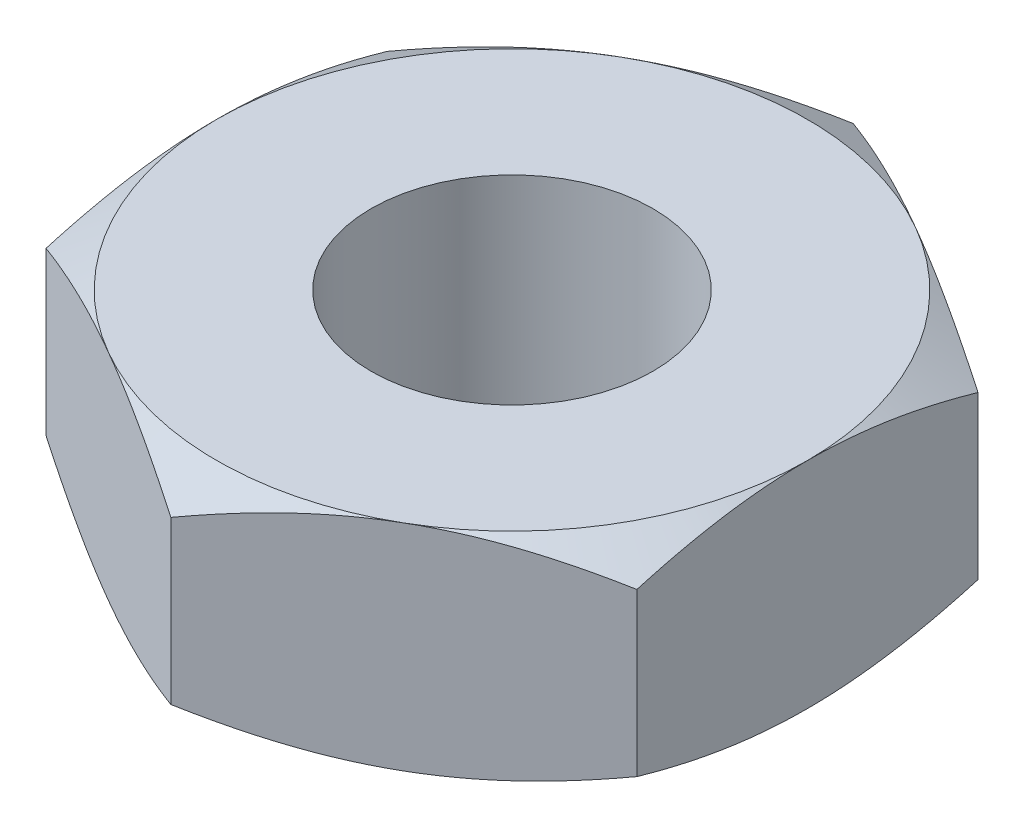
ISO-10303-21;
HEADER;
FILE_DESCRIPTION(('STEP AP214'),'2;1');
FILE_NAME('part.step','',(''),(''),'','','');
FILE_SCHEMA(('AUTOMOTIVE_DESIGN { 1 0 10303 214 1 1 1 1 }'));
ENDSEC;
DATA;
#1=APPLICATION_CONTEXT('core data for automotive mechanical design processes');
#2=APPLICATION_PROTOCOL_DEFINITION('international standard','automotive_design',2000,#1);
#3=PRODUCT_CONTEXT('',#1,'mechanical');
#4=PRODUCT('Part','Part','',(#3));
#5=PRODUCT_RELATED_PRODUCT_CATEGORY('part','',(#4));
#6=PRODUCT_DEFINITION_FORMATION('','',#4);
#7=PRODUCT_DEFINITION_CONTEXT('part definition',#1,'design');
#8=PRODUCT_DEFINITION('design','',#6,#7);
#9=PRODUCT_DEFINITION_SHAPE('','',#8);
#10=(LENGTH_UNIT() NAMED_UNIT(*) SI_UNIT(.MILLI.,.METRE.));
#11=(NAMED_UNIT(*) PLANE_ANGLE_UNIT() SI_UNIT($,.RADIAN.));
#12=(NAMED_UNIT(*) SI_UNIT($,.STERADIAN.) SOLID_ANGLE_UNIT());
#13=UNCERTAINTY_MEASURE_WITH_UNIT(LENGTH_MEASURE(1.E-05),#10,'distance_accuracy_value','');
#14=(GEOMETRIC_REPRESENTATION_CONTEXT(3) GLOBAL_UNCERTAINTY_ASSIGNED_CONTEXT((#13)) GLOBAL_UNIT_ASSIGNED_CONTEXT((#10,
#11,#12)) REPRESENTATION_CONTEXT('',''));
#15=CARTESIAN_POINT('',(0.,0.,0.));
#16=DIRECTION('',(0.,0.,1.));
#17=DIRECTION('',(1.,0.,0.));
#18=AXIS2_PLACEMENT_3D('',#15,#16,#17);
#19=CARTESIAN_POINT('',(-4.365625,1.5875,-2.52049476893096));
#20=DIRECTION('',(0.,1.,0.));
#21=DIRECTION('',(0.,0.,1.));
#22=AXIS2_PLACEMENT_3D('',#19,#20,#21);
#23=PLANE('',#22);
#24=CARTESIAN_POINT('',(0.,1.5875,0.));
#25=DIRECTION('',(0.,1.,0.));
#26=DIRECTION('',(0.,0.,1.));
#27=AXIS2_PLACEMENT_3D('',#24,#25,#26);
#28=CIRCLE('',#27,2.0828);
#29=CARTESIAN_POINT('',(0.,1.5875,2.0828));
#30=VERTEX_POINT('',#29);
#31=EDGE_CURVE('E265',#30,#30,#28,.T.);
#32=ORIENTED_EDGE('',*,*,#31,.F.);
#33=EDGE_LOOP('',(#32));
#34=FACE_BOUND('',#33,.T.);
#35=CARTESIAN_POINT('',(0.,1.5875,0.));
#36=DIRECTION('',(0.,1.,0.));
#37=DIRECTION('',(0.,0.,1.));
#38=AXIS2_PLACEMENT_3D('',#35,#36,#37);
#39=CIRCLE('',#38,4.365625);
#40=CARTESIAN_POINT('',(-2.1828125,1.5875,3.78074215339644));
#41=VERTEX_POINT('',#40);
#42=CARTESIAN_POINT('',(2.1828125,1.5875,3.78074215339644));
#43=VERTEX_POINT('',#42);
#44=EDGE_CURVE('E334',#41,#43,#39,.T.);
#45=ORIENTED_EDGE('',*,*,#44,.T.);
#46=CARTESIAN_POINT('',(4.365625,1.5875,0.));
#47=VERTEX_POINT('',#46);
#48=EDGE_CURVE('E338',#43,#47,#39,.T.);
#49=ORIENTED_EDGE('',*,*,#48,.T.);
#50=CARTESIAN_POINT('',(2.1828125,1.5875,-3.78074215339644));
#51=VERTEX_POINT('',#50);
#52=EDGE_CURVE('E347',#47,#51,#39,.T.);
#53=ORIENTED_EDGE('',*,*,#52,.T.);
#54=CARTESIAN_POINT('',(-2.1828125,1.5875,-3.78074215339644));
#55=VERTEX_POINT('',#54);
#56=EDGE_CURVE('E353',#51,#55,#39,.T.);
#57=ORIENTED_EDGE('',*,*,#56,.T.);
#58=CARTESIAN_POINT('',(-4.365625,1.5875,0.));
#59=VERTEX_POINT('',#58);
#60=EDGE_CURVE('E343',#55,#59,#39,.T.);
#61=ORIENTED_EDGE('',*,*,#60,.T.);
#62=EDGE_CURVE('E337',#59,#41,#39,.T.);
#63=ORIENTED_EDGE('',*,*,#62,.T.);
#64=EDGE_LOOP('',(#45,#49,#53,#57,#61,#63));
#65=FACE_BOUND('',#64,.T.);
#66=ADVANCED_FACE('F47',(#34,#65),#23,.T.);
#67=CARTESIAN_POINT('',(0.,1.5875,-5.04098953786192));
#68=DIRECTION('',(0.5,0.,0.866025403784439));
#69=DIRECTION('',(0.866025403784439,0.,-0.5));
#70=AXIS2_PLACEMENT_3D('',#67,#68,#69);
#71=PLANE('',#70);
#72=DIRECTION('',(0.,-1.,0.));
#73=VECTOR('',#72,1.);
#74=CARTESIAN_POINT('',(0.,1.5875,-5.04098953786192));
#75=LINE('',#74,#73);
#76=CARTESIAN_POINT('',(0.,1.1975781022643,-5.04098953786192));
#77=VERTEX_POINT('',#76);
#78=CARTESIAN_POINT('',(0.,-1.1975781022643,-5.04098953786192));
#79=VERTEX_POINT('',#78);
#80=EDGE_CURVE('E261',#77,#79,#75,.T.);
#81=ORIENTED_EDGE('',*,*,#80,.T.);
#82=CARTESIAN_POINT('',(0.000200000000000447,-1.19751143330706,-5.04110500791576));
#83=CARTESIAN_POINT('',(-0.191646154756631,-1.26148303939287,-4.93034257882402));
#84=CARTESIAN_POINT('',(-0.385148315347934,-1.31966270339327,-4.81862405431786));
#85=CARTESIAN_POINT('',(-0.775503272136697,-1.4212154789496,-4.59325251493636));
#86=CARTESIAN_POINT('',(-0.97236300396655,-1.46455266558374,-4.4795954957718));
#87=CARTESIAN_POINT('',(-1.36364278230571,-1.53201274711872,-4.25369001041923));
#88=CARTESIAN_POINT('',(-1.55800262852651,-1.5565846340745,-4.141476300884));
#89=CARTESIAN_POINT('',(-1.94763676784797,-1.58591739318914,-3.91652092566128));
#90=CARTESIAN_POINT('',(-2.1429096449017,-1.5907025564277,-3.80378007752888));
#91=CARTESIAN_POINT('',(-2.50778242850786,-1.58074337568916,-3.59312067769389));
#92=CARTESIAN_POINT('',(-2.67743697788687,-1.56844434705368,-3.49517057794068));
#93=CARTESIAN_POINT('',(-3.01564078774565,-1.52946500734803,-3.29990851727775));
#94=CARTESIAN_POINT('',(-3.18418887859895,-1.50277138313893,-3.2025972316522));
#95=CARTESIAN_POINT('',(-3.5230899005224,-1.43603992336617,-3.00693263541606));
#96=CARTESIAN_POINT('',(-3.69339994212082,-1.39571923834841,-2.90860408705351));
#97=CARTESIAN_POINT('',(-4.0314800095833,-1.30420734471812,-2.7134134690964));
#98=CARTESIAN_POINT('',(-4.19925436616289,-1.25303763580728,-2.61654889916207));
#99=CARTESIAN_POINT('',(-4.365825,-1.19751143330706,-2.52037929887712));
#100=B_SPLINE_CURVE_WITH_KNOTS('',3,(#82,#83,#84,#85,#86,#87,#88,#89,#90,#91,#92,#93,#94,#95,
#96,#97,#98,#99),.UNSPECIFIED.,.F.,.F.,(4,2,2,2,2,2,2,2,4),(0.,0.692002325262096,
1.38566793682621,2.06216593124082,2.73783317900963,3.32613108280982,3.91497402160196,
4.51687782793768,5.11759979729738),.UNSPECIFIED.);
#101=CARTESIAN_POINT('',(-2.1828125,-1.5875,-3.78074215339644));
#102=VERTEX_POINT('',#101);
#103=EDGE_CURVE('E71',#79,#102,#100,.T.);
#104=ORIENTED_EDGE('',*,*,#103,.T.);
#105=CARTESIAN_POINT('',(-4.365625,-1.19757810226447,-2.52049476893123));
#106=VERTEX_POINT('',#105);
#107=EDGE_CURVE('E212',#102,#106,#100,.T.);
#108=ORIENTED_EDGE('',*,*,#107,.T.);
#109=DIRECTION('',(0.,-1.,0.));
#110=VECTOR('',#109,1.);
#111=CARTESIAN_POINT('',(-4.365625,1.5875,-2.52049476893096));
#112=LINE('',#111,#110);
#113=CARTESIAN_POINT('',(-4.365625,1.19757810226447,-2.52049476893123));
#114=VERTEX_POINT('',#113);
#115=EDGE_CURVE('E244',#114,#106,#112,.T.);
#116=ORIENTED_EDGE('',*,*,#115,.F.);
#117=CARTESIAN_POINT('',(0.000200000000000447,1.19751143330706,-5.04110500791576));
#118=CARTESIAN_POINT('',(-0.191646154756631,1.26148303939287,-4.93034257882402));
#119=CARTESIAN_POINT('',(-0.385148315347934,1.31966270339327,-4.81862405431786));
#120=CARTESIAN_POINT('',(-0.775503272136697,1.4212154789496,-4.59325251493636));
#121=CARTESIAN_POINT('',(-0.97236300396655,1.46455266558374,-4.4795954957718));
#122=CARTESIAN_POINT('',(-1.36364278230571,1.53201274711872,-4.25369001041923));
#123=CARTESIAN_POINT('',(-1.55800262852651,1.5565846340745,-4.141476300884));
#124=CARTESIAN_POINT('',(-1.94763676784797,1.58591739318914,-3.91652092566128));
#125=CARTESIAN_POINT('',(-2.1429096449017,1.5907025564277,-3.80378007752888));
#126=CARTESIAN_POINT('',(-2.50778242850786,1.58074337568916,-3.59312067769389));
#127=CARTESIAN_POINT('',(-2.67743697788687,1.56844434705368,-3.49517057794068));
#128=CARTESIAN_POINT('',(-3.01564078774565,1.52946500734803,-3.29990851727775));
#129=CARTESIAN_POINT('',(-3.18418887859895,1.50277138313893,-3.2025972316522));
#130=CARTESIAN_POINT('',(-3.5230899005224,1.43603992336617,-3.00693263541606));
#131=CARTESIAN_POINT('',(-3.69339994212082,1.39571923834841,-2.90860408705351));
#132=CARTESIAN_POINT('',(-4.0314800095833,1.30420734471812,-2.7134134690964));
#133=CARTESIAN_POINT('',(-4.19925436616289,1.25303763580728,-2.61654889916207));
#134=CARTESIAN_POINT('',(-4.365825,1.19751143330706,-2.52037929887712));
#135=B_SPLINE_CURVE_WITH_KNOTS('',3,(#117,#118,#119,#120,#121,#122,#123,#124,#125,#126,#127,
#128,#129,#130,#131,#132,#133,#134),.UNSPECIFIED.,.F.,.F.,(4,2,2,2,2,2,2,2,4),(0.,
0.692002325262096,1.38566793682621,2.06216593124082,2.73783317900963,3.32613108280982,
3.91497402160196,4.51687782793768,5.11759979729738),.UNSPECIFIED.);
#136=EDGE_CURVE('E274',#55,#114,#135,.T.);
#137=ORIENTED_EDGE('',*,*,#136,.F.);
#138=EDGE_CURVE('E270',#77,#55,#135,.T.);
#139=ORIENTED_EDGE('',*,*,#138,.F.);
#140=EDGE_LOOP('',(#81,#104,#108,#116,#137,#139));
#141=FACE_BOUND('',#140,.T.);
#142=ADVANCED_FACE('F49',(#141),#71,.F.);
#143=CARTESIAN_POINT('',(-4.365625,1.5875,-2.52049476893096));
#144=DIRECTION('',(1.,0.,0.));
#145=DIRECTION('',(0.,0.,-1.));
#146=AXIS2_PLACEMENT_3D('',#143,#144,#145);
#147=PLANE('',#146);
#148=ORIENTED_EDGE('',*,*,#115,.T.);
#149=CARTESIAN_POINT('',(-4.365625,0.582853969932464,-6.85226269432697));
#150=CARTESIAN_POINT('',(-4.365625,0.489680156453973,-6.66086007604859));
#151=CARTESIAN_POINT('',(-4.365625,0.397376434842135,-6.46902672948962));
#152=CARTESIAN_POINT('',(-4.365625,0.214997026563551,-6.08426977951739));
#153=CARTESIAN_POINT('',(-4.365625,0.124921675806986,-5.89134601705212));
#154=CARTESIAN_POINT('',(-4.365625,-0.0529487966471366,-5.50322446705241));
#155=CARTESIAN_POINT('',(-4.365625,-0.140729530343638,-5.30802006350404));
#156=CARTESIAN_POINT('',(-4.365625,-0.312805770529424,-4.91608678168324));
#157=CARTESIAN_POINT('',(-4.365625,-0.397101436483579,-4.71935797365258));
#158=CARTESIAN_POINT('',(-4.365625,-0.564033799203991,-4.31745718322505));
#159=CARTESIAN_POINT('',(-4.365625,-0.646520923624076,-4.1122227427791));
#160=CARTESIAN_POINT('',(-4.365625,-0.805448225522392,-3.6993832955));
#161=CARTESIAN_POINT('',(-4.365625,-0.881887736179952,-3.49177803013545));
#162=CARTESIAN_POINT('',(-4.365625,-1.02677332018676,-3.07422922373289));
#163=CARTESIAN_POINT('',(-4.365625,-1.09523487860667,-2.86429110901678));
#164=CARTESIAN_POINT('',(-4.365625,-1.22202224200298,-2.44140449503534));
#165=CARTESIAN_POINT('',(-4.365625,-1.28035115288086,-2.22845693995526));
#166=CARTESIAN_POINT('',(-4.365625,-1.38382046738014,-1.80060272143903));
#167=CARTESIAN_POINT('',(-4.365625,-1.4290337863496,-1.58571401627004));
#168=CARTESIAN_POINT('',(-4.365625,-1.50376633433157,-1.15318078427098));
#169=CARTESIAN_POINT('',(-4.365625,-1.53328723678874,-0.935536553826391));
#170=CARTESIAN_POINT('',(-4.365625,-1.57389736889336,-0.501455789297704));
#171=CARTESIAN_POINT('',(-4.365625,-1.58522999122152,-0.285042602489581));
#172=CARTESIAN_POINT('',(-4.365625,-1.58914889598309,0.147975850152554));
#173=CARTESIAN_POINT('',(-4.365625,-1.58173485492717,0.364581119236632));
#174=CARTESIAN_POINT('',(-4.365625,-1.55395538963215,0.729876421153978));
#175=CARTESIAN_POINT('',(-4.365625,-1.53827953520473,0.878946702826805));
#176=CARTESIAN_POINT('',(-4.365625,-1.4989807781673,1.17604297503692));
#177=CARTESIAN_POINT('',(-4.365625,-1.47535686605304,1.32406883047922));
#178=CARTESIAN_POINT('',(-4.365625,-1.39379991830766,1.76635224887574));
#179=CARTESIAN_POINT('',(-4.365625,-1.32519457778451,2.05866634107682));
#180=CARTESIAN_POINT('',(-4.365625,-1.20561113739948,2.49596286516616));
#181=CARTESIAN_POINT('',(-4.365625,-1.16238195329627,2.64319377066846));
#182=CARTESIAN_POINT('',(-4.365625,-1.07128204855368,2.93622644062659));
#183=CARTESIAN_POINT('',(-4.365625,-1.02341129281123,3.08202819426491));
#184=CARTESIAN_POINT('',(-4.365625,-0.923809074757655,3.37224745572901));
#185=CARTESIAN_POINT('',(-4.365625,-0.872078736024324,3.51666535270643));
#186=CARTESIAN_POINT('',(-4.365625,-0.76538114851868,3.80429296151375));
#187=CARTESIAN_POINT('',(-4.365625,-0.710413969542451,3.94750269931915));
#188=CARTESIAN_POINT('',(-4.365625,-0.560210026859073,4.32803169660156));
#189=CARTESIAN_POINT('',(-4.365625,-0.462570477282239,4.56440155359593));
#190=CARTESIAN_POINT('',(-4.365625,-0.261679300392085,5.03475295776304));
#191=CARTESIAN_POINT('',(-4.365625,-0.158427086169404,5.26873425211637));
#192=CARTESIAN_POINT('',(-4.365625,0.0523768674881459,5.73483883645864));
#193=CARTESIAN_POINT('',(-4.365625,0.159930018031642,5.96696148615629));
#194=CARTESIAN_POINT('',(-4.365625,0.378332789089623,6.42965401147059));
#195=CARTESIAN_POINT('',(-4.365625,0.489182507141913,6.66022384089483));
#196=CARTESIAN_POINT('',(-4.365625,0.713633286563212,7.12044940428769));
#197=CARTESIAN_POINT('',(-4.365625,0.827238253786936,7.35010322953361));
#198=CARTESIAN_POINT('',(-4.365625,1.05651320798877,7.80837882560589));
#199=CARTESIAN_POINT('',(-4.365625,1.17218321651816,8.03700058563013));
#200=CARTESIAN_POINT('',(-4.365625,1.52161771981947,8.72150449475708));
#201=CARTESIAN_POINT('',(-4.365625,1.75785514977995,9.17612368326433));
#202=CARTESIAN_POINT('',(-4.365625,2.21006597005731,10.0360794022934));
#203=CARTESIAN_POINT('',(-4.365625,2.42560519233602,10.4416453446333));
#204=CARTESIAN_POINT('',(-4.365625,2.85930683468753,11.251401989355));
#205=CARTESIAN_POINT('',(-4.365625,3.07746940756578,11.6555926098503));
#206=CARTESIAN_POINT('',(-4.365625,3.515027293591,12.4616018249325));
#207=CARTESIAN_POINT('',(-4.365625,3.73441628270763,12.8634238580517));
#208=CARTESIAN_POINT('',(-4.365625,4.17468970540454,13.6662084551018));
#209=CARTESIAN_POINT('',(-4.365625,4.39557402413294,14.0671710819952));
#210=CARTESIAN_POINT('',(-4.365625,4.61700375131891,14.4678303796549));
#211=B_SPLINE_CURVE_WITH_KNOTS('',3,(#149,#150,#151,#152,#153,#154,#155,#156,#157,#158,#159,
#160,#161,#162,#163,#164,#165,#166,#167,#168,#169,#170,#171,#172,#173,#174,#175,#176,#177,#178,
#179,#180,#181,#182,#183,#184,#185,#186,#187,#188,#189,#190,#191,#192,#193,#194,#195,#196,#197,
#198,#199,#200,#201,#202,#203,#204,#205,#206,#207,#208,#209,#210),.UNSPECIFIED.,.F.,.F.,(4,2,2,
2,2,2,2,2,2,2,2,2,2,2,2,2,2,2,2,2,2,2,2,2,2,2,2,2,2,2,4),(0.,0.638636339428223,1.27736836901639,
1.91944068585148,2.56148359104784,3.22498181560936,3.88855309700325,4.55081415348392,
5.21287185136149,5.87117506256677,6.52940805800167,7.17875695039341,7.82811704791935,
8.27757735599096,8.72709477279348,9.62657719175833,10.086874168077,10.5471746257808,
11.0073416026298,11.4674986605153,12.2346185268086,13.0018187647637,13.7692728151199,
14.5367495953018,15.3053865596148,16.07403155031,17.6109924865833,18.9888317280411,
20.36675161872,21.7401863682929,23.1135167989047),.UNSPECIFIED.);
#212=CARTESIAN_POINT('',(-4.365625,-1.5875,0.));
#213=VERTEX_POINT('',#212);
#214=EDGE_CURVE('E310',#106,#213,#211,.T.);
#215=ORIENTED_EDGE('',*,*,#214,.T.);
#216=CARTESIAN_POINT('',(-4.365625,-1.1975781022643,2.52049476893096));
#217=VERTEX_POINT('',#216);
#218=EDGE_CURVE('E303',#213,#217,#211,.T.);
#219=ORIENTED_EDGE('',*,*,#218,.T.);
#220=DIRECTION('',(0.,-1.,0.));
#221=VECTOR('',#220,1.);
#222=CARTESIAN_POINT('',(-4.365625,1.5875,2.52049476893096));
#223=LINE('',#222,#221);
#224=CARTESIAN_POINT('',(-4.365625,1.1975781022643,2.52049476893096));
#225=VERTEX_POINT('',#224);
#226=EDGE_CURVE('E248',#225,#217,#223,.T.);
#227=ORIENTED_EDGE('',*,*,#226,.F.);
#228=CARTESIAN_POINT('',(-4.365625,-0.582853969932464,-6.85226269432697));
#229=CARTESIAN_POINT('',(-4.365625,-0.489680156453973,-6.66086007604859));
#230=CARTESIAN_POINT('',(-4.365625,-0.397376434842135,-6.46902672948962));
#231=CARTESIAN_POINT('',(-4.365625,-0.214997026563551,-6.08426977951739));
#232=CARTESIAN_POINT('',(-4.365625,-0.124921675806986,-5.89134601705212));
#233=CARTESIAN_POINT('',(-4.365625,0.0529487966471366,-5.50322446705241));
#234=CARTESIAN_POINT('',(-4.365625,0.140729530343638,-5.30802006350404));
#235=CARTESIAN_POINT('',(-4.365625,0.312805770529424,-4.91608678168324));
#236=CARTESIAN_POINT('',(-4.365625,0.397101436483579,-4.71935797365258));
#237=CARTESIAN_POINT('',(-4.365625,0.564033799203991,-4.31745718322505));
#238=CARTESIAN_POINT('',(-4.365625,0.646520923624076,-4.1122227427791));
#239=CARTESIAN_POINT('',(-4.365625,0.805448225522392,-3.6993832955));
#240=CARTESIAN_POINT('',(-4.365625,0.881887736179952,-3.49177803013545));
#241=CARTESIAN_POINT('',(-4.365625,1.02677332018676,-3.07422922373289));
#242=CARTESIAN_POINT('',(-4.365625,1.09523487860667,-2.86429110901678));
#243=CARTESIAN_POINT('',(-4.365625,1.22202224200298,-2.44140449503534));
#244=CARTESIAN_POINT('',(-4.365625,1.28035115288086,-2.22845693995526));
#245=CARTESIAN_POINT('',(-4.365625,1.38382046738014,-1.80060272143903));
#246=CARTESIAN_POINT('',(-4.365625,1.4290337863496,-1.58571401627004));
#247=CARTESIAN_POINT('',(-4.365625,1.50376633433157,-1.15318078427098));
#248=CARTESIAN_POINT('',(-4.365625,1.53328723678874,-0.935536553826391));
#249=CARTESIAN_POINT('',(-4.365625,1.57389736889336,-0.501455789297704));
#250=CARTESIAN_POINT('',(-4.365625,1.58522999122152,-0.285042602489581));
#251=CARTESIAN_POINT('',(-4.365625,1.58914889598309,0.147975850152554));
#252=CARTESIAN_POINT('',(-4.365625,1.58173485492717,0.364581119236632));
#253=CARTESIAN_POINT('',(-4.365625,1.55395538963215,0.729876421153978));
#254=CARTESIAN_POINT('',(-4.365625,1.53827953520473,0.878946702826805));
#255=CARTESIAN_POINT('',(-4.365625,1.4989807781673,1.17604297503692));
#256=CARTESIAN_POINT('',(-4.365625,1.47535686605304,1.32406883047922));
#257=CARTESIAN_POINT('',(-4.365625,1.39379991830766,1.76635224887574));
#258=CARTESIAN_POINT('',(-4.365625,1.32519457778451,2.05866634107682));
#259=CARTESIAN_POINT('',(-4.365625,1.20561113739948,2.49596286516616));
#260=CARTESIAN_POINT('',(-4.365625,1.16238195329627,2.64319377066846));
#261=CARTESIAN_POINT('',(-4.365625,1.07128204855368,2.93622644062659));
#262=CARTESIAN_POINT('',(-4.365625,1.02341129281123,3.08202819426491));
#263=CARTESIAN_POINT('',(-4.365625,0.923809074757655,3.37224745572901));
#264=CARTESIAN_POINT('',(-4.365625,0.872078736024324,3.51666535270643));
#265=CARTESIAN_POINT('',(-4.365625,0.76538114851868,3.80429296151375));
#266=CARTESIAN_POINT('',(-4.365625,0.710413969542451,3.94750269931915));
#267=CARTESIAN_POINT('',(-4.365625,0.560210026859073,4.32803169660156));
#268=CARTESIAN_POINT('',(-4.365625,0.462570477282239,4.56440155359593));
#269=CARTESIAN_POINT('',(-4.365625,0.261679300392085,5.03475295776304));
#270=CARTESIAN_POINT('',(-4.365625,0.158427086169404,5.26873425211637));
#271=CARTESIAN_POINT('',(-4.365625,-0.0523768674881459,5.73483883645864));
#272=CARTESIAN_POINT('',(-4.365625,-0.159930018031642,5.96696148615629));
#273=CARTESIAN_POINT('',(-4.365625,-0.378332789089623,6.42965401147059));
#274=CARTESIAN_POINT('',(-4.365625,-0.489182507141913,6.66022384089483));
#275=CARTESIAN_POINT('',(-4.365625,-0.713633286563212,7.12044940428769));
#276=CARTESIAN_POINT('',(-4.365625,-0.827238253786936,7.35010322953361));
#277=CARTESIAN_POINT('',(-4.365625,-1.05651320798877,7.80837882560589));
#278=CARTESIAN_POINT('',(-4.365625,-1.17218321651816,8.03700058563013));
#279=CARTESIAN_POINT('',(-4.365625,-1.52161771981947,8.72150449475708));
#280=CARTESIAN_POINT('',(-4.365625,-1.75785514977995,9.17612368326433));
#281=CARTESIAN_POINT('',(-4.365625,-2.21006597005731,10.0360794022934));
#282=CARTESIAN_POINT('',(-4.365625,-2.42560519233602,10.4416453446333));
#283=CARTESIAN_POINT('',(-4.365625,-2.85930683468753,11.251401989355));
#284=CARTESIAN_POINT('',(-4.365625,-3.07746940756578,11.6555926098503));
#285=CARTESIAN_POINT('',(-4.365625,-3.515027293591,12.4616018249325));
#286=CARTESIAN_POINT('',(-4.365625,-3.73441628270763,12.8634238580517));
#287=CARTESIAN_POINT('',(-4.365625,-4.17468970540454,13.6662084551018));
#288=CARTESIAN_POINT('',(-4.365625,-4.39557402413294,14.0671710819952));
#289=CARTESIAN_POINT('',(-4.365625,-4.61700375131891,14.4678303796549));
#290=B_SPLINE_CURVE_WITH_KNOTS('',3,(#228,#229,#230,#231,#232,#233,#234,#235,#236,#237,#238,
#239,#240,#241,#242,#243,#244,#245,#246,#247,#248,#249,#250,#251,#252,#253,#254,#255,#256,#257,
#258,#259,#260,#261,#262,#263,#264,#265,#266,#267,#268,#269,#270,#271,#272,#273,#274,#275,#276,
#277,#278,#279,#280,#281,#282,#283,#284,#285,#286,#287,#288,#289),.UNSPECIFIED.,.F.,.F.,(4,2,2,
2,2,2,2,2,2,2,2,2,2,2,2,2,2,2,2,2,2,2,2,2,2,2,2,2,2,2,4),(0.,0.638636339428223,1.27736836901639,
1.91944068585148,2.56148359104784,3.22498181560936,3.88855309700325,4.55081415348392,
5.21287185136149,5.87117506256677,6.52940805800167,7.17875695039341,7.82811704791935,
8.27757735599096,8.72709477279348,9.62657719175833,10.086874168077,10.5471746257808,
11.0073416026298,11.4674986605153,12.2346185268086,13.0018187647637,13.7692728151199,
14.5367495953018,15.3053865596148,16.07403155031,17.6109924865833,18.9888317280411,
20.36675161872,21.7401863682929,23.1135167989047),.UNSPECIFIED.);
#291=EDGE_CURVE('E282',#59,#225,#290,.T.);
#292=ORIENTED_EDGE('',*,*,#291,.F.);
#293=EDGE_CURVE('E281',#114,#59,#290,.T.);
#294=ORIENTED_EDGE('',*,*,#293,.F.);
#295=EDGE_LOOP('',(#148,#215,#219,#227,#292,#294));
#296=FACE_BOUND('',#295,.T.);
#297=ADVANCED_FACE('F296',(#296),#147,.F.);
#298=CARTESIAN_POINT('',(-4.365625,1.5875,2.52049476893096));
#299=DIRECTION('',(0.5,0.,-0.866025403784439));
#300=DIRECTION('',(-0.866025403784439,0.,-0.5));
#301=AXIS2_PLACEMENT_3D('',#298,#299,#300);
#302=PLANE('',#301);
#303=ORIENTED_EDGE('',*,*,#226,.T.);
#304=CARTESIAN_POINT('',(-4.365825,-1.19751143330706,2.52037929887712));
#305=CARTESIAN_POINT('',(-4.17397884524337,-1.26148303939287,2.63114172796886));
#306=CARTESIAN_POINT('',(-3.98047668465207,-1.31966270339327,2.74286025247502));
#307=CARTESIAN_POINT('',(-3.5901217278633,-1.4212154789496,2.96823179185652));
#308=CARTESIAN_POINT('',(-3.39326199603345,-1.46455266558374,3.08188881102108));
#309=CARTESIAN_POINT('',(-3.00198221769429,-1.53201274711872,3.30779429637365));
#310=CARTESIAN_POINT('',(-2.80762237147349,-1.5565846340745,3.42000800590889));
#311=CARTESIAN_POINT('',(-2.41798823215203,-1.58591739318914,3.6449633811316));
#312=CARTESIAN_POINT('',(-2.2227153550983,-1.5907025564277,3.757704229264));
#313=CARTESIAN_POINT('',(-1.85784257149214,-1.58074337568916,3.96836362909899));
#314=CARTESIAN_POINT('',(-1.68818802211313,-1.56844434705368,4.0663137288522));
#315=CARTESIAN_POINT('',(-1.34998421225435,-1.52946500734802,4.26157578951513));
#316=CARTESIAN_POINT('',(-1.18143612140105,-1.50277138313893,4.35888707514068));
#317=CARTESIAN_POINT('',(-0.842535099477602,-1.43603992336617,4.55455167137682));
#318=CARTESIAN_POINT('',(-0.672225057879177,-1.39571923834841,4.65288021973937));
#319=CARTESIAN_POINT('',(-0.334144990416698,-1.30420734471812,4.84807083769647));
#320=CARTESIAN_POINT('',(-0.166370633837115,-1.25303763580728,4.94493540763081));
#321=CARTESIAN_POINT('',(0.000199999999999048,-1.19751143330706,5.04110500791576));
#322=B_SPLINE_CURVE_WITH_KNOTS('',3,(#304,#305,#306,#307,#308,#309,#310,#311,#312,#313,#314,
#315,#316,#317,#318,#319,#320,#321),.UNSPECIFIED.,.F.,.F.,(4,2,2,2,2,2,2,2,4),(0.,
0.692002325262095,1.38566793682621,2.06216593124082,2.73783317900963,3.32613108280982,
3.91497402160196,4.51687782793768,5.11759979729738),.UNSPECIFIED.);
#323=CARTESIAN_POINT('',(-2.1828125,-1.5875,3.78074215339644));
#324=VERTEX_POINT('',#323);
#325=EDGE_CURVE('E177',#217,#324,#322,.T.);
#326=ORIENTED_EDGE('',*,*,#325,.T.);
#327=CARTESIAN_POINT('',(0.,-1.1975781022643,5.04098953786192));
#328=VERTEX_POINT('',#327);
#329=EDGE_CURVE('E157',#324,#328,#322,.T.);
#330=ORIENTED_EDGE('',*,*,#329,.T.);
#331=DIRECTION('',(0.,-1.,0.));
#332=VECTOR('',#331,1.);
#333=CARTESIAN_POINT('',(0.,1.5875,5.04098953786192));
#334=LINE('',#333,#332);
#335=CARTESIAN_POINT('',(0.,1.1975781022643,5.04098953786192));
#336=VERTEX_POINT('',#335);
#337=EDGE_CURVE('E174',#336,#328,#334,.T.);
#338=ORIENTED_EDGE('',*,*,#337,.F.);
#339=CARTESIAN_POINT('',(-4.365825,1.19751143330706,2.52037929887712));
#340=CARTESIAN_POINT('',(-4.17397884524337,1.26148303939287,2.63114172796886));
#341=CARTESIAN_POINT('',(-3.98047668465207,1.31966270339327,2.74286025247502));
#342=CARTESIAN_POINT('',(-3.5901217278633,1.4212154789496,2.96823179185652));
#343=CARTESIAN_POINT('',(-3.39326199603345,1.46455266558374,3.08188881102108));
#344=CARTESIAN_POINT('',(-3.00198221769429,1.53201274711872,3.30779429637365));
#345=CARTESIAN_POINT('',(-2.80762237147349,1.5565846340745,3.42000800590889));
#346=CARTESIAN_POINT('',(-2.41798823215203,1.58591739318914,3.6449633811316));
#347=CARTESIAN_POINT('',(-2.2227153550983,1.5907025564277,3.757704229264));
#348=CARTESIAN_POINT('',(-1.85784257149214,1.58074337568916,3.96836362909899));
#349=CARTESIAN_POINT('',(-1.68818802211313,1.56844434705368,4.0663137288522));
#350=CARTESIAN_POINT('',(-1.34998421225435,1.52946500734802,4.26157578951513));
#351=CARTESIAN_POINT('',(-1.18143612140105,1.50277138313893,4.35888707514068));
#352=CARTESIAN_POINT('',(-0.842535099477602,1.43603992336617,4.55455167137682));
#353=CARTESIAN_POINT('',(-0.672225057879177,1.39571923834841,4.65288021973937));
#354=CARTESIAN_POINT('',(-0.334144990416698,1.30420734471812,4.84807083769647));
#355=CARTESIAN_POINT('',(-0.166370633837115,1.25303763580728,4.94493540763081));
#356=CARTESIAN_POINT('',(0.000199999999999048,1.19751143330706,5.04110500791576));
#357=B_SPLINE_CURVE_WITH_KNOTS('',3,(#339,#340,#341,#342,#343,#344,#345,#346,#347,#348,#349,
#350,#351,#352,#353,#354,#355,#356),.UNSPECIFIED.,.F.,.F.,(4,2,2,2,2,2,2,2,4),(0.,
0.692002325262095,1.38566793682621,2.06216593124082,2.73783317900963,3.32613108280982,
3.91497402160196,4.51687782793768,5.11759979729738),.UNSPECIFIED.);
#358=EDGE_CURVE('E290',#41,#336,#357,.T.);
#359=ORIENTED_EDGE('',*,*,#358,.F.);
#360=EDGE_CURVE('E289',#225,#41,#357,.T.);
#361=ORIENTED_EDGE('',*,*,#360,.F.);
#362=EDGE_LOOP('',(#303,#326,#330,#338,#359,#361));
#363=FACE_BOUND('',#362,.T.);
#364=ADVANCED_FACE('F299',(#363),#302,.F.);
#365=CARTESIAN_POINT('',(0.,1.5875,5.04098953786192));
#366=DIRECTION('',(-0.5,0.,-0.866025403784438));
#367=DIRECTION('',(-0.866025403784439,0.,0.5));
#368=AXIS2_PLACEMENT_3D('',#365,#366,#367);
#369=PLANE('',#368);
#370=ORIENTED_EDGE('',*,*,#337,.T.);
#371=CARTESIAN_POINT('',(-0.000200000000001692,-1.19751143330706,5.04110500791576));
#372=CARTESIAN_POINT('',(0.19164615475663,-1.26148303939287,4.93034257882402));
#373=CARTESIAN_POINT('',(0.385148315347932,-1.31966270339327,4.81862405431786));
#374=CARTESIAN_POINT('',(0.775503272136695,-1.4212154789496,4.59325251493636));
#375=CARTESIAN_POINT('',(0.972363003966548,-1.46455266558375,4.4795954957718));
#376=CARTESIAN_POINT('',(1.36364278230571,-1.53201274711872,4.25369001041923));
#377=CARTESIAN_POINT('',(1.55800262852651,-1.5565846340745,4.141476300884));
#378=CARTESIAN_POINT('',(1.94763676784797,-1.58591739318914,3.91652092566128));
#379=CARTESIAN_POINT('',(2.1429096449017,-1.5907025564277,3.80378007752888));
#380=CARTESIAN_POINT('',(2.50778242850786,-1.58074337568916,3.59312067769389));
#381=CARTESIAN_POINT('',(2.67743697788687,-1.56844434705368,3.49517057794068));
#382=CARTESIAN_POINT('',(3.01564078774565,-1.52946500734803,3.29990851727775));
#383=CARTESIAN_POINT('',(3.18418887859895,-1.50277138313893,3.2025972316522));
#384=CARTESIAN_POINT('',(3.5230899005224,-1.43603992336617,3.00693263541606));
#385=CARTESIAN_POINT('',(3.69339994212082,-1.39571923834841,2.90860408705351));
#386=CARTESIAN_POINT('',(4.0314800095833,-1.30420734471812,2.7134134690964));
#387=CARTESIAN_POINT('',(4.19925436616288,-1.25303763580728,2.61654889916207));
#388=CARTESIAN_POINT('',(4.365825,-1.19751143330706,2.52037929887712));
#389=B_SPLINE_CURVE_WITH_KNOTS('',3,(#371,#372,#373,#374,#375,#376,#377,#378,#379,#380,#381,
#382,#383,#384,#385,#386,#387,#388),.UNSPECIFIED.,.F.,.F.,(4,2,2,2,2,2,2,2,4),(0.,
0.692002325262095,1.38566793682621,2.06216593124082,2.73783317900963,3.32613108280982,
3.91497402160196,4.51687782793768,5.11759979729738),.UNSPECIFIED.);
#390=CARTESIAN_POINT('',(2.1828125,-1.5875,3.78074215339644));
#391=VERTEX_POINT('',#390);
#392=EDGE_CURVE('E151',#328,#391,#389,.T.);
#393=ORIENTED_EDGE('',*,*,#392,.T.);
#394=CARTESIAN_POINT('',(4.365625,-1.1975781022643,2.52049476893096));
#395=VERTEX_POINT('',#394);
#396=EDGE_CURVE('E138',#391,#395,#389,.T.);
#397=ORIENTED_EDGE('',*,*,#396,.T.);
#398=DIRECTION('',(0.,-1.,0.));
#399=VECTOR('',#398,1.);
#400=CARTESIAN_POINT('',(4.365625,1.5875,2.52049476893096));
#401=LINE('',#400,#399);
#402=CARTESIAN_POINT('',(4.365625,1.1975781022643,2.52049476893096));
#403=VERTEX_POINT('',#402);
#404=EDGE_CURVE('E254',#403,#395,#401,.T.);
#405=ORIENTED_EDGE('',*,*,#404,.F.);
#406=CARTESIAN_POINT('',(-0.000200000000001692,1.19751143330706,5.04110500791576));
#407=CARTESIAN_POINT('',(0.19164615475663,1.26148303939287,4.93034257882402));
#408=CARTESIAN_POINT('',(0.385148315347932,1.31966270339327,4.81862405431786));
#409=CARTESIAN_POINT('',(0.775503272136695,1.4212154789496,4.59325251493636));
#410=CARTESIAN_POINT('',(0.972363003966548,1.46455266558375,4.4795954957718));
#411=CARTESIAN_POINT('',(1.36364278230571,1.53201274711872,4.25369001041923));
#412=CARTESIAN_POINT('',(1.55800262852651,1.5565846340745,4.141476300884));
#413=CARTESIAN_POINT('',(1.94763676784797,1.58591739318914,3.91652092566128));
#414=CARTESIAN_POINT('',(2.1429096449017,1.5907025564277,3.80378007752888));
#415=CARTESIAN_POINT('',(2.50778242850786,1.58074337568916,3.59312067769389));
#416=CARTESIAN_POINT('',(2.67743697788687,1.56844434705368,3.49517057794068));
#417=CARTESIAN_POINT('',(3.01564078774565,1.52946500734803,3.29990851727775));
#418=CARTESIAN_POINT('',(3.18418887859895,1.50277138313893,3.2025972316522));
#419=CARTESIAN_POINT('',(3.5230899005224,1.43603992336617,3.00693263541606));
#420=CARTESIAN_POINT('',(3.69339994212082,1.39571923834841,2.90860408705351));
#421=CARTESIAN_POINT('',(4.0314800095833,1.30420734471812,2.7134134690964));
#422=CARTESIAN_POINT('',(4.19925436616288,1.25303763580728,2.61654889916207));
#423=CARTESIAN_POINT('',(4.365825,1.19751143330706,2.52037929887712));
#424=B_SPLINE_CURVE_WITH_KNOTS('',3,(#406,#407,#408,#409,#410,#411,#412,#413,#414,#415,#416,
#417,#418,#419,#420,#421,#422,#423),.UNSPECIFIED.,.F.,.F.,(4,2,2,2,2,2,2,2,4),(0.,
0.692002325262095,1.38566793682621,2.06216593124082,2.73783317900963,3.32613108280982,
3.91497402160196,4.51687782793768,5.11759979729738),.UNSPECIFIED.);
#425=EDGE_CURVE('E373',#43,#403,#424,.T.);
#426=ORIENTED_EDGE('',*,*,#425,.F.);
#427=EDGE_CURVE('E370',#336,#43,#424,.T.);
#428=ORIENTED_EDGE('',*,*,#427,.F.);
#429=EDGE_LOOP('',(#370,#393,#397,#405,#426,#428));
#430=FACE_BOUND('',#429,.T.);
#431=ADVANCED_FACE('F171',(#430),#369,.F.);
#432=CARTESIAN_POINT('',(4.365625,1.5875,2.52049476893096));
#433=DIRECTION('',(-1.,0.,0.));
#434=DIRECTION('',(0.,0.,1.));
#435=AXIS2_PLACEMENT_3D('',#432,#433,#434);
#436=PLANE('',#435);
#437=ORIENTED_EDGE('',*,*,#404,.T.);
#438=CARTESIAN_POINT('',(4.365625,0.582853969932464,-6.85226269432697));
#439=CARTESIAN_POINT('',(4.365625,0.489680156453973,-6.66086007604859));
#440=CARTESIAN_POINT('',(4.365625,0.397376434842135,-6.46902672948962));
#441=CARTESIAN_POINT('',(4.365625,0.214997026563551,-6.08426977951739));
#442=CARTESIAN_POINT('',(4.365625,0.124921675806986,-5.89134601705212));
#443=CARTESIAN_POINT('',(4.365625,-0.0529487966471363,-5.50322446705242));
#444=CARTESIAN_POINT('',(4.365625,-0.140729530343638,-5.30802006350404));
#445=CARTESIAN_POINT('',(4.365625,-0.312805770529423,-4.91608678168325));
#446=CARTESIAN_POINT('',(4.365625,-0.397101436483578,-4.71935797365259));
#447=CARTESIAN_POINT('',(4.365625,-0.56403379920399,-4.31745718322506));
#448=CARTESIAN_POINT('',(4.365625,-0.646520923624075,-4.11222274277911));
#449=CARTESIAN_POINT('',(4.365625,-0.805448225522392,-3.69938329550001));
#450=CARTESIAN_POINT('',(4.365625,-0.881887736179953,-3.49177803013545));
#451=CARTESIAN_POINT('',(4.365625,-1.02677332018676,-3.07422922373289));
#452=CARTESIAN_POINT('',(4.365625,-1.09523487860667,-2.86429110901679));
#453=CARTESIAN_POINT('',(4.365625,-1.22202224200298,-2.44140449503534));
#454=CARTESIAN_POINT('',(4.365625,-1.28035115288086,-2.22845693995526));
#455=CARTESIAN_POINT('',(4.365625,-1.38382046738014,-1.80060272143903));
#456=CARTESIAN_POINT('',(4.365625,-1.4290337863496,-1.58571401627004));
#457=CARTESIAN_POINT('',(4.365625,-1.50376633433157,-1.15318078427098));
#458=CARTESIAN_POINT('',(4.365625,-1.53328723678875,-0.935536553826395));
#459=CARTESIAN_POINT('',(4.365625,-1.57389736889337,-0.501455789297708));
#460=CARTESIAN_POINT('',(4.365625,-1.58522999122152,-0.285042602489585));
#461=CARTESIAN_POINT('',(4.365625,-1.58914889598309,0.147975850152549));
#462=CARTESIAN_POINT('',(4.365625,-1.58173485492717,0.364581119236627));
#463=CARTESIAN_POINT('',(4.365625,-1.55395538963215,0.729876421153973));
#464=CARTESIAN_POINT('',(4.365625,-1.53827953520474,0.8789467028268));
#465=CARTESIAN_POINT('',(4.365625,-1.49898077816731,1.17604297503692));
#466=CARTESIAN_POINT('',(4.365625,-1.47535686605304,1.32406883047922));
#467=CARTESIAN_POINT('',(4.365625,-1.39379991830766,1.76635224887574));
#468=CARTESIAN_POINT('',(4.365625,-1.32519457778451,2.05866634107681));
#469=CARTESIAN_POINT('',(4.365625,-1.20561113739948,2.49596286516615));
#470=CARTESIAN_POINT('',(4.365625,-1.16238195329627,2.64319377066846));
#471=CARTESIAN_POINT('',(4.365625,-1.07128204855368,2.93622644062659));
#472=CARTESIAN_POINT('',(4.365625,-1.02341129281124,3.0820281942649));
#473=CARTESIAN_POINT('',(4.365625,-0.923809074757659,3.372247455729));
#474=CARTESIAN_POINT('',(4.365625,-0.872078736024328,3.51666535270642));
#475=CARTESIAN_POINT('',(4.365625,-0.765381148518685,3.80429296151374));
#476=CARTESIAN_POINT('',(4.365625,-0.710413969542456,3.94750269931914));
#477=CARTESIAN_POINT('',(4.365625,-0.560210026859079,4.32803169660155));
#478=CARTESIAN_POINT('',(4.365625,-0.462570477282244,4.56440155359592));
#479=CARTESIAN_POINT('',(4.365625,-0.26167930039209,5.03475295776303));
#480=CARTESIAN_POINT('',(4.365625,-0.15842708616941,5.26873425211636));
#481=CARTESIAN_POINT('',(4.365625,0.0523768674881413,5.73483883645863));
#482=CARTESIAN_POINT('',(4.365625,0.159930018031638,5.96696148615629));
#483=CARTESIAN_POINT('',(4.365625,0.378332789089619,6.42965401147059));
#484=CARTESIAN_POINT('',(4.365625,0.489182507141909,6.66022384089483));
#485=CARTESIAN_POINT('',(4.365625,0.713633286563208,7.12044940428768));
#486=CARTESIAN_POINT('',(4.365625,0.827238253786933,7.35010322953361));
#487=CARTESIAN_POINT('',(4.365625,1.05651320798876,7.80837882560589));
#488=CARTESIAN_POINT('',(4.365625,1.17218321651816,8.03700058563013));
#489=CARTESIAN_POINT('',(4.365625,1.52161771981946,8.72150449475708));
#490=CARTESIAN_POINT('',(4.365625,1.75785514977995,9.17612368326433));
#491=CARTESIAN_POINT('',(4.365625,2.21006597005731,10.0360794022934));
#492=CARTESIAN_POINT('',(4.365625,2.42560519233602,10.4416453446333));
#493=CARTESIAN_POINT('',(4.365625,2.85930683468752,11.251401989355));
#494=CARTESIAN_POINT('',(4.365625,3.07746940756578,11.6555926098503));
#495=CARTESIAN_POINT('',(4.365625,3.515027293591,12.4616018249325));
#496=CARTESIAN_POINT('',(4.365625,3.73441628270763,12.8634238580517));
#497=CARTESIAN_POINT('',(4.365625,4.17468970540453,13.6662084551018));
#498=CARTESIAN_POINT('',(4.365625,4.39557402413293,14.0671710819952));
#499=CARTESIAN_POINT('',(4.365625,4.61700375131891,14.4678303796549));
#500=B_SPLINE_CURVE_WITH_KNOTS('',3,(#438,#439,#440,#441,#442,#443,#444,#445,#446,#447,#448,
#449,#450,#451,#452,#453,#454,#455,#456,#457,#458,#459,#460,#461,#462,#463,#464,#465,#466,#467,
#468,#469,#470,#471,#472,#473,#474,#475,#476,#477,#478,#479,#480,#481,#482,#483,#484,#485,#486,
#487,#488,#489,#490,#491,#492,#493,#494,#495,#496,#497,#498,#499),.UNSPECIFIED.,.F.,.F.,(4,2,2,
2,2,2,2,2,2,2,2,2,2,2,2,2,2,2,2,2,2,2,2,2,2,2,2,2,2,2,4),(0.,0.638636339428221,1.27736836901638,
1.91944068585148,2.56148359104783,3.22498181560935,3.88855309700325,4.55081415348391,
5.21287185136149,5.87117506256677,6.52940805800167,7.17875695039341,7.82811704791934,
8.27757735599096,8.72709477279347,9.62657719175833,10.086874168077,10.5471746257808,
11.0073416026298,11.4674986605153,12.2346185268086,13.0018187647637,13.7692728151199,
14.5367495953018,15.3053865596148,16.07403155031,17.6109924865833,18.9888317280411,
20.36675161872,21.7401863682929,23.1135167989047),.UNSPECIFIED.);
#501=CARTESIAN_POINT('',(4.365625,-1.5875,0.));
#502=VERTEX_POINT('',#501);
#503=EDGE_CURVE('E145',#395,#502,#500,.F.);
#504=ORIENTED_EDGE('',*,*,#503,.T.);
#505=CARTESIAN_POINT('',(4.365625,-1.1975781022643,-2.52049476893096));
#506=VERTEX_POINT('',#505);
#507=EDGE_CURVE('E186',#502,#506,#500,.F.);
#508=ORIENTED_EDGE('',*,*,#507,.T.);
#509=DIRECTION('',(0.,-1.,0.));
#510=VECTOR('',#509,1.);
#511=CARTESIAN_POINT('',(4.365625,1.5875,-2.52049476893096));
#512=LINE('',#511,#510);
#513=CARTESIAN_POINT('',(4.365625,1.1975781022643,-2.52049476893096));
#514=VERTEX_POINT('',#513);
#515=EDGE_CURVE('E257',#514,#506,#512,.T.);
#516=ORIENTED_EDGE('',*,*,#515,.F.);
#517=CARTESIAN_POINT('',(4.365625,-0.582853969932464,-6.85226269432697));
#518=CARTESIAN_POINT('',(4.365625,-0.489680156453973,-6.66086007604859));
#519=CARTESIAN_POINT('',(4.365625,-0.397376434842135,-6.46902672948962));
#520=CARTESIAN_POINT('',(4.365625,-0.214997026563551,-6.08426977951739));
#521=CARTESIAN_POINT('',(4.365625,-0.124921675806986,-5.89134601705212));
#522=CARTESIAN_POINT('',(4.365625,0.0529487966471363,-5.50322446705242));
#523=CARTESIAN_POINT('',(4.365625,0.140729530343638,-5.30802006350404));
#524=CARTESIAN_POINT('',(4.365625,0.312805770529423,-4.91608678168325));
#525=CARTESIAN_POINT('',(4.365625,0.397101436483578,-4.71935797365259));
#526=CARTESIAN_POINT('',(4.365625,0.56403379920399,-4.31745718322506));
#527=CARTESIAN_POINT('',(4.365625,0.646520923624075,-4.11222274277911));
#528=CARTESIAN_POINT('',(4.365625,0.805448225522392,-3.69938329550001));
#529=CARTESIAN_POINT('',(4.365625,0.881887736179953,-3.49177803013545));
#530=CARTESIAN_POINT('',(4.365625,1.02677332018676,-3.07422922373289));
#531=CARTESIAN_POINT('',(4.365625,1.09523487860667,-2.86429110901679));
#532=CARTESIAN_POINT('',(4.365625,1.22202224200298,-2.44140449503534));
#533=CARTESIAN_POINT('',(4.365625,1.28035115288086,-2.22845693995526));
#534=CARTESIAN_POINT('',(4.365625,1.38382046738014,-1.80060272143903));
#535=CARTESIAN_POINT('',(4.365625,1.4290337863496,-1.58571401627004));
#536=CARTESIAN_POINT('',(4.365625,1.50376633433157,-1.15318078427098));
#537=CARTESIAN_POINT('',(4.365625,1.53328723678875,-0.935536553826395));
#538=CARTESIAN_POINT('',(4.365625,1.57389736889337,-0.501455789297708));
#539=CARTESIAN_POINT('',(4.365625,1.58522999122152,-0.285042602489585));
#540=CARTESIAN_POINT('',(4.365625,1.58914889598309,0.147975850152549));
#541=CARTESIAN_POINT('',(4.365625,1.58173485492717,0.364581119236627));
#542=CARTESIAN_POINT('',(4.365625,1.55395538963215,0.729876421153973));
#543=CARTESIAN_POINT('',(4.365625,1.53827953520474,0.8789467028268));
#544=CARTESIAN_POINT('',(4.365625,1.49898077816731,1.17604297503692));
#545=CARTESIAN_POINT('',(4.365625,1.47535686605304,1.32406883047922));
#546=CARTESIAN_POINT('',(4.365625,1.39379991830766,1.76635224887574));
#547=CARTESIAN_POINT('',(4.365625,1.32519457778451,2.05866634107681));
#548=CARTESIAN_POINT('',(4.365625,1.20561113739948,2.49596286516615));
#549=CARTESIAN_POINT('',(4.365625,1.16238195329627,2.64319377066846));
#550=CARTESIAN_POINT('',(4.365625,1.07128204855368,2.93622644062659));
#551=CARTESIAN_POINT('',(4.365625,1.02341129281124,3.0820281942649));
#552=CARTESIAN_POINT('',(4.365625,0.923809074757659,3.372247455729));
#553=CARTESIAN_POINT('',(4.365625,0.872078736024328,3.51666535270642));
#554=CARTESIAN_POINT('',(4.365625,0.765381148518685,3.80429296151374));
#555=CARTESIAN_POINT('',(4.365625,0.710413969542456,3.94750269931914));
#556=CARTESIAN_POINT('',(4.365625,0.560210026859079,4.32803169660155));
#557=CARTESIAN_POINT('',(4.365625,0.462570477282244,4.56440155359592));
#558=CARTESIAN_POINT('',(4.365625,0.26167930039209,5.03475295776303));
#559=CARTESIAN_POINT('',(4.365625,0.15842708616941,5.26873425211636));
#560=CARTESIAN_POINT('',(4.365625,-0.0523768674881413,5.73483883645863));
#561=CARTESIAN_POINT('',(4.365625,-0.159930018031638,5.96696148615629));
#562=CARTESIAN_POINT('',(4.365625,-0.378332789089619,6.42965401147059));
#563=CARTESIAN_POINT('',(4.365625,-0.489182507141909,6.66022384089483));
#564=CARTESIAN_POINT('',(4.365625,-0.713633286563208,7.12044940428768));
#565=CARTESIAN_POINT('',(4.365625,-0.827238253786933,7.35010322953361));
#566=CARTESIAN_POINT('',(4.365625,-1.05651320798876,7.80837882560589));
#567=CARTESIAN_POINT('',(4.365625,-1.17218321651816,8.03700058563013));
#568=CARTESIAN_POINT('',(4.365625,-1.52161771981946,8.72150449475708));
#569=CARTESIAN_POINT('',(4.365625,-1.75785514977995,9.17612368326433));
#570=CARTESIAN_POINT('',(4.365625,-2.21006597005731,10.0360794022934));
#571=CARTESIAN_POINT('',(4.365625,-2.42560519233602,10.4416453446333));
#572=CARTESIAN_POINT('',(4.365625,-2.85930683468752,11.251401989355));
#573=CARTESIAN_POINT('',(4.365625,-3.07746940756578,11.6555926098503));
#574=CARTESIAN_POINT('',(4.365625,-3.515027293591,12.4616018249325));
#575=CARTESIAN_POINT('',(4.365625,-3.73441628270763,12.8634238580517));
#576=CARTESIAN_POINT('',(4.365625,-4.17468970540453,13.6662084551018));
#577=CARTESIAN_POINT('',(4.365625,-4.39557402413293,14.0671710819952));
#578=CARTESIAN_POINT('',(4.365625,-4.61700375131891,14.4678303796549));
#579=B_SPLINE_CURVE_WITH_KNOTS('',3,(#517,#518,#519,#520,#521,#522,#523,#524,#525,#526,#527,
#528,#529,#530,#531,#532,#533,#534,#535,#536,#537,#538,#539,#540,#541,#542,#543,#544,#545,#546,
#547,#548,#549,#550,#551,#552,#553,#554,#555,#556,#557,#558,#559,#560,#561,#562,#563,#564,#565,
#566,#567,#568,#569,#570,#571,#572,#573,#574,#575,#576,#577,#578),.UNSPECIFIED.,.F.,.F.,(4,2,2,
2,2,2,2,2,2,2,2,2,2,2,2,2,2,2,2,2,2,2,2,2,2,2,2,2,2,2,4),(0.,0.638636339428221,1.27736836901638,
1.91944068585148,2.56148359104783,3.22498181560935,3.88855309700325,4.55081415348391,
5.21287185136149,5.87117506256677,6.52940805800167,7.17875695039341,7.82811704791934,
8.27757735599096,8.72709477279347,9.62657719175833,10.086874168077,10.5471746257808,
11.0073416026298,11.4674986605153,12.2346185268086,13.0018187647637,13.7692728151199,
14.5367495953018,15.3053865596148,16.07403155031,17.6109924865833,18.9888317280411,
20.36675161872,21.7401863682929,23.1135167989047),.UNSPECIFIED.);
#580=EDGE_CURVE('E346',#47,#514,#579,.F.);
#581=ORIENTED_EDGE('',*,*,#580,.F.);
#582=EDGE_CURVE('E352',#403,#47,#579,.F.);
#583=ORIENTED_EDGE('',*,*,#582,.F.);
#584=EDGE_LOOP('',(#437,#504,#508,#516,#581,#583));
#585=FACE_BOUND('',#584,.T.);
#586=ADVANCED_FACE('F232',(#585),#436,.F.);
#587=CARTESIAN_POINT('',(4.365625,1.5875,-2.52049476893096));
#588=DIRECTION('',(-0.5,0.,0.866025403784439));
#589=DIRECTION('',(0.866025403784439,0.,0.5));
#590=AXIS2_PLACEMENT_3D('',#587,#588,#589);
#591=PLANE('',#590);
#592=ORIENTED_EDGE('',*,*,#515,.T.);
#593=CARTESIAN_POINT('',(4.365825,-1.19751143330706,-2.52037929887713));
#594=CARTESIAN_POINT('',(4.17397884524337,-1.26148303939287,-2.63114172796886));
#595=CARTESIAN_POINT('',(3.98047668465206,-1.31966270339327,-2.74286025247502));
#596=CARTESIAN_POINT('',(3.5901217278633,-1.4212154789496,-2.96823179185652));
#597=CARTESIAN_POINT('',(3.39326199603345,-1.46455266558374,-3.08188881102108));
#598=CARTESIAN_POINT('',(3.00198221769429,-1.53201274711872,-3.30779429637365));
#599=CARTESIAN_POINT('',(2.80762237147349,-1.5565846340745,-3.42000800590889));
#600=CARTESIAN_POINT('',(2.41798823215203,-1.58591739318914,-3.6449633811316));
#601=CARTESIAN_POINT('',(2.2227153550983,-1.5907025564277,-3.75770422926401));
#602=CARTESIAN_POINT('',(1.85784257149214,-1.58074337568916,-3.96836362909899));
#603=CARTESIAN_POINT('',(1.68818802211313,-1.56844434705368,-4.06631372885221));
#604=CARTESIAN_POINT('',(1.34998421225435,-1.52946500734802,-4.26157578951513));
#605=CARTESIAN_POINT('',(1.18143612140105,-1.50277138313893,-4.35888707514068));
#606=CARTESIAN_POINT('',(0.8425350994776,-1.43603992336617,-4.55455167137682));
#607=CARTESIAN_POINT('',(0.672225057879175,-1.39571923834841,-4.65288021973937));
#608=CARTESIAN_POINT('',(0.334144990416697,-1.30420734471812,-4.84807083769647));
#609=CARTESIAN_POINT('',(0.166370633837113,-1.25303763580728,-4.94493540763081));
#610=CARTESIAN_POINT('',(-0.000199999999999814,-1.19751143330706,-5.04110500791576));
#611=B_SPLINE_CURVE_WITH_KNOTS('',3,(#593,#594,#595,#596,#597,#598,#599,#600,#601,#602,#603,
#604,#605,#606,#607,#608,#609,#610),.UNSPECIFIED.,.F.,.F.,(4,2,2,2,2,2,2,2,4),(0.,
0.692002325262095,1.38566793682621,2.06216593124082,2.73783317900963,3.32613108280982,
3.91497402160196,4.51687782793767,5.11759979729738),.UNSPECIFIED.);
#612=CARTESIAN_POINT('',(2.1828125,-1.5875,-3.78074215339644));
#613=VERTEX_POINT('',#612);
#614=EDGE_CURVE('E227',#506,#613,#611,.T.);
#615=ORIENTED_EDGE('',*,*,#614,.T.);
#616=EDGE_CURVE('E168',#613,#79,#611,.T.);
#617=ORIENTED_EDGE('',*,*,#616,.T.);
#618=ORIENTED_EDGE('',*,*,#80,.F.);
#619=CARTESIAN_POINT('',(4.365825,1.19751143330706,-2.52037929887713));
#620=CARTESIAN_POINT('',(4.17397884524337,1.26148303939287,-2.63114172796886));
#621=CARTESIAN_POINT('',(3.98047668465206,1.31966270339327,-2.74286025247502));
#622=CARTESIAN_POINT('',(3.5901217278633,1.4212154789496,-2.96823179185652));
#623=CARTESIAN_POINT('',(3.39326199603345,1.46455266558374,-3.08188881102108));
#624=CARTESIAN_POINT('',(3.00198221769429,1.53201274711872,-3.30779429637365));
#625=CARTESIAN_POINT('',(2.80762237147349,1.5565846340745,-3.42000800590889));
#626=CARTESIAN_POINT('',(2.41798823215203,1.58591739318914,-3.6449633811316));
#627=CARTESIAN_POINT('',(2.2227153550983,1.5907025564277,-3.75770422926401));
#628=CARTESIAN_POINT('',(1.85784257149214,1.58074337568916,-3.96836362909899));
#629=CARTESIAN_POINT('',(1.68818802211313,1.56844434705368,-4.06631372885221));
#630=CARTESIAN_POINT('',(1.34998421225435,1.52946500734802,-4.26157578951513));
#631=CARTESIAN_POINT('',(1.18143612140105,1.50277138313893,-4.35888707514068));
#632=CARTESIAN_POINT('',(0.8425350994776,1.43603992336617,-4.55455167137682));
#633=CARTESIAN_POINT('',(0.672225057879175,1.39571923834841,-4.65288021973937));
#634=CARTESIAN_POINT('',(0.334144990416697,1.30420734471812,-4.84807083769647));
#635=CARTESIAN_POINT('',(0.166370633837113,1.25303763580728,-4.94493540763081));
#636=CARTESIAN_POINT('',(-0.000199999999999814,1.19751143330706,-5.04110500791576));
#637=B_SPLINE_CURVE_WITH_KNOTS('',3,(#619,#620,#621,#622,#623,#624,#625,#626,#627,#628,#629,
#630,#631,#632,#633,#634,#635,#636),.UNSPECIFIED.,.F.,.F.,(4,2,2,2,2,2,2,2,4),(0.,
0.692002325262095,1.38566793682621,2.06216593124082,2.73783317900963,3.32613108280982,
3.91497402160196,4.51687782793767,5.11759979729738),.UNSPECIFIED.);
#638=EDGE_CURVE('E237',#51,#77,#637,.T.);
#639=ORIENTED_EDGE('',*,*,#638,.F.);
#640=EDGE_CURVE('E162',#514,#51,#637,.T.);
#641=ORIENTED_EDGE('',*,*,#640,.F.);
#642=EDGE_LOOP('',(#592,#615,#617,#618,#639,#641));
#643=FACE_BOUND('',#642,.T.);
#644=ADVANCED_FACE('F228',(#643),#591,.F.);
#645=CARTESIAN_POINT('',(-4.365625,-1.5875,-2.52049476893096));
#646=DIRECTION('',(0.,1.,0.));
#647=DIRECTION('',(0.,0.,1.));
#648=AXIS2_PLACEMENT_3D('',#645,#646,#647);
#649=PLANE('',#648);
#650=CARTESIAN_POINT('',(0.,-1.5875,0.));
#651=DIRECTION('',(0.,1.,0.));
#652=DIRECTION('',(0.,0.,1.));
#653=AXIS2_PLACEMENT_3D('',#650,#651,#652);
#654=CIRCLE('',#653,4.365625);
#655=EDGE_CURVE('E52',#391,#324,#654,.F.);
#656=ORIENTED_EDGE('',*,*,#655,.T.);
#657=EDGE_CURVE('E12',#324,#213,#654,.F.);
#658=ORIENTED_EDGE('',*,*,#657,.T.);
#659=EDGE_CURVE('E58',#213,#102,#654,.F.);
#660=ORIENTED_EDGE('',*,*,#659,.T.);
#661=EDGE_CURVE('E323',#102,#613,#654,.F.);
#662=ORIENTED_EDGE('',*,*,#661,.T.);
#663=EDGE_CURVE('E161',#613,#502,#654,.F.);
#664=ORIENTED_EDGE('',*,*,#663,.T.);
#665=CARTESIAN_POINT('',(0.,-1.5875,0.));
#666=DIRECTION('',(0.,1.,0.));
#667=DIRECTION('',(0.,0.,1.));
#668=AXIS2_PLACEMENT_3D('',#665,#666,#667);
#669=CIRCLE('',#668,4.365625);
#670=EDGE_CURVE('E142',#391,#502,#669,.T.);
#671=ORIENTED_EDGE('',*,*,#670,.F.);
#672=EDGE_LOOP('',(#656,#658,#660,#662,#664,#671));
#673=FACE_BOUND('',#672,.T.);
#674=CARTESIAN_POINT('',(0.,-1.5875,0.));
#675=DIRECTION('',(0.,1.,0.));
#676=DIRECTION('',(0.,0.,1.));
#677=AXIS2_PLACEMENT_3D('',#674,#675,#676);
#678=CIRCLE('',#677,2.0828);
#679=CARTESIAN_POINT('',(0.,-1.5875,2.0828));
#680=VERTEX_POINT('',#679);
#681=EDGE_CURVE('E266',#680,#680,#678,.T.);
#682=ORIENTED_EDGE('',*,*,#681,.T.);
#683=EDGE_LOOP('',(#682));
#684=FACE_BOUND('',#683,.T.);
#685=ADVANCED_FACE('F163',(#673,#684),#649,.F.);
#686=CARTESIAN_POINT('',(0.,1.5875,0.));
#687=DIRECTION('',(0.,-1.,0.));
#688=DIRECTION('',(0.,0.,-1.));
#689=AXIS2_PLACEMENT_3D('',#686,#687,#688);
#690=CYLINDRICAL_SURFACE('',#689,2.0828);
#691=ORIENTED_EDGE('',*,*,#31,.T.);
#692=EDGE_LOOP('',(#691));
#693=FACE_BOUND('',#692,.T.);
#694=ORIENTED_EDGE('',*,*,#681,.F.);
#695=EDGE_LOOP('',(#694));
#696=FACE_BOUND('',#695,.T.);
#697=ADVANCED_FACE('F420',(#693,#696),#690,.F.);
#698=CARTESIAN_POINT('',(0.,1.5875,0.));
#699=DIRECTION('',(0.,-1.,0.));
#700=DIRECTION('',(0.,0.,1.));
#701=AXIS2_PLACEMENT_3D('',#698,#699,#700);
#702=CONICAL_SURFACE('',#701,4.365625,1.0471975511966);
#703=ORIENTED_EDGE('',*,*,#138,.T.);
#704=ORIENTED_EDGE('',*,*,#56,.F.);
#705=ORIENTED_EDGE('',*,*,#638,.T.);
#706=EDGE_LOOP('',(#703,#704,#705));
#707=FACE_BOUND('',#706,.T.);
#708=ADVANCED_FACE('F206',(#707),#702,.T.);
#709=ORIENTED_EDGE('',*,*,#580,.T.);
#710=ORIENTED_EDGE('',*,*,#640,.T.);
#711=ORIENTED_EDGE('',*,*,#52,.F.);
#712=EDGE_LOOP('',(#709,#710,#711));
#713=FACE_BOUND('',#712,.T.);
#714=ADVANCED_FACE('F393',(#713),#702,.T.);
#715=ORIENTED_EDGE('',*,*,#425,.T.);
#716=ORIENTED_EDGE('',*,*,#582,.T.);
#717=ORIENTED_EDGE('',*,*,#48,.F.);
#718=EDGE_LOOP('',(#715,#716,#717));
#719=FACE_BOUND('',#718,.T.);
#720=ADVANCED_FACE('F387',(#719),#702,.T.);
#721=ORIENTED_EDGE('',*,*,#358,.T.);
#722=ORIENTED_EDGE('',*,*,#427,.T.);
#723=ORIENTED_EDGE('',*,*,#44,.F.);
#724=EDGE_LOOP('',(#721,#722,#723));
#725=FACE_BOUND('',#724,.T.);
#726=ADVANCED_FACE('F403',(#725),#702,.T.);
#727=ORIENTED_EDGE('',*,*,#291,.T.);
#728=ORIENTED_EDGE('',*,*,#360,.T.);
#729=ORIENTED_EDGE('',*,*,#62,.F.);
#730=EDGE_LOOP('',(#727,#728,#729));
#731=FACE_BOUND('',#730,.T.);
#732=ADVANCED_FACE('F406',(#731),#702,.T.);
#733=ORIENTED_EDGE('',*,*,#136,.T.);
#734=ORIENTED_EDGE('',*,*,#293,.T.);
#735=ORIENTED_EDGE('',*,*,#60,.F.);
#736=EDGE_LOOP('',(#733,#734,#735));
#737=FACE_BOUND('',#736,.T.);
#738=ADVANCED_FACE('F360',(#737),#702,.T.);
#739=CARTESIAN_POINT('',(0.,-1.5875,0.));
#740=DIRECTION('',(0.,1.,0.));
#741=DIRECTION('',(0.,0.,1.));
#742=AXIS2_PLACEMENT_3D('',#739,#740,#741);
#743=CONICAL_SURFACE('',#742,4.365625,1.0471975511966);
#744=ORIENTED_EDGE('',*,*,#655,.F.);
#745=ORIENTED_EDGE('',*,*,#392,.F.);
#746=ORIENTED_EDGE('',*,*,#329,.F.);
#747=EDGE_LOOP('',(#744,#745,#746));
#748=FACE_BOUND('',#747,.T.);
#749=ADVANCED_FACE('F155',(#748),#743,.T.);
#750=ORIENTED_EDGE('',*,*,#670,.T.);
#751=ORIENTED_EDGE('',*,*,#503,.F.);
#752=ORIENTED_EDGE('',*,*,#396,.F.);
#753=EDGE_LOOP('',(#750,#751,#752));
#754=FACE_BOUND('',#753,.T.);
#755=ADVANCED_FACE('F140',(#754),#743,.T.);
#756=ORIENTED_EDGE('',*,*,#663,.F.);
#757=ORIENTED_EDGE('',*,*,#614,.F.);
#758=ORIENTED_EDGE('',*,*,#507,.F.);
#759=EDGE_LOOP('',(#756,#757,#758));
#760=FACE_BOUND('',#759,.T.);
#761=ADVANCED_FACE('F205',(#760),#743,.T.);
#762=ORIENTED_EDGE('',*,*,#616,.F.);
#763=ORIENTED_EDGE('',*,*,#661,.F.);
#764=ORIENTED_EDGE('',*,*,#103,.F.);
#765=EDGE_LOOP('',(#762,#763,#764));
#766=FACE_BOUND('',#765,.T.);
#767=ADVANCED_FACE('F200',(#766),#743,.T.);
#768=ORIENTED_EDGE('',*,*,#659,.F.);
#769=ORIENTED_EDGE('',*,*,#214,.F.);
#770=ORIENTED_EDGE('',*,*,#107,.F.);
#771=EDGE_LOOP('',(#768,#769,#770));
#772=FACE_BOUND('',#771,.T.);
#773=ADVANCED_FACE('F204',(#772),#743,.T.);
#774=ORIENTED_EDGE('',*,*,#657,.F.);
#775=ORIENTED_EDGE('',*,*,#325,.F.);
#776=ORIENTED_EDGE('',*,*,#218,.F.);
#777=EDGE_LOOP('',(#774,#775,#776));
#778=FACE_BOUND('',#777,.T.);
#779=ADVANCED_FACE('F317',(#778),#743,.T.);
#780=CLOSED_SHELL('',(#66,#142,#297,#364,#431,#586,#644,#685,#697,#708,#714,#720,#726,#732,#738,
#749,#755,#761,#767,#773,#779));
#781=MANIFOLD_SOLID_BREP('B2',#780);
#782=ADVANCED_BREP_SHAPE_REPRESENTATION('',(#18,#781),#14);
#783=SHAPE_DEFINITION_REPRESENTATION(#9,#782);
ENDSEC;
END-ISO-10303-21;
